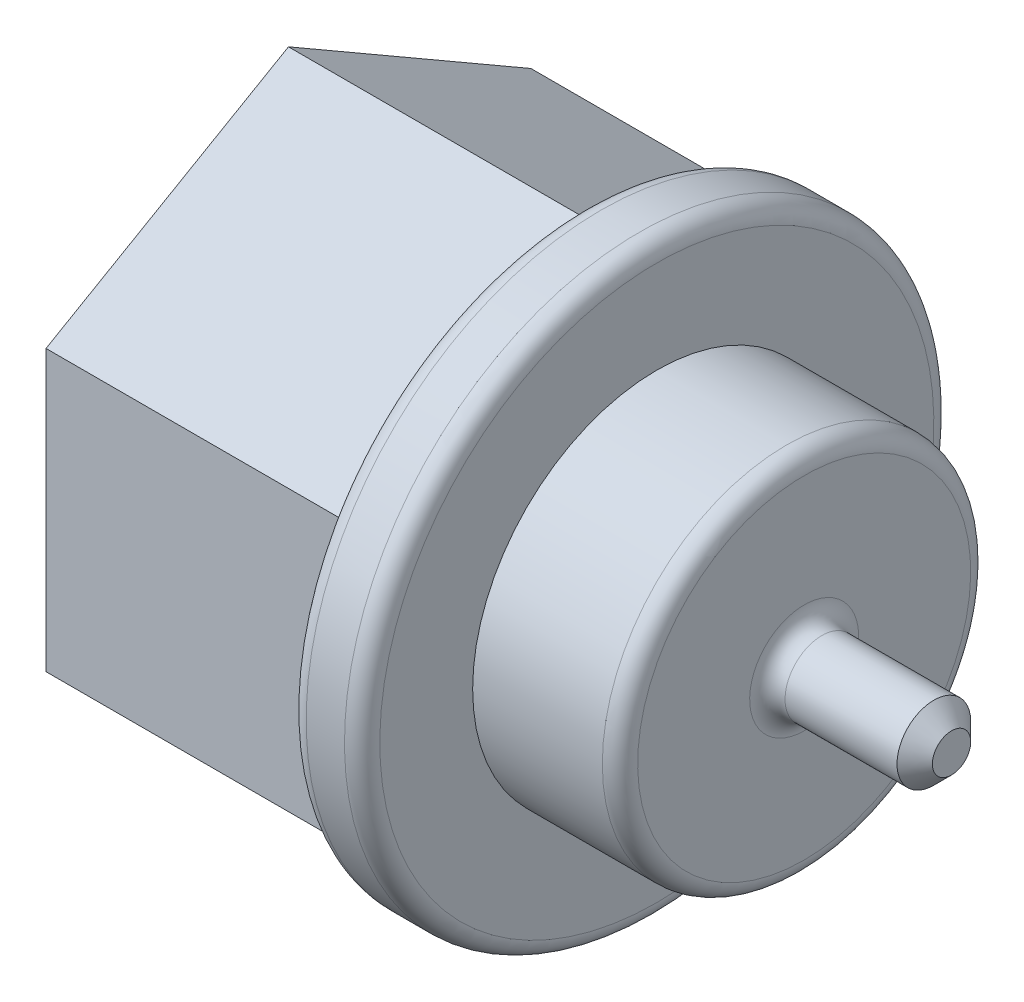
ISO-10303-21;
HEADER;
FILE_DESCRIPTION(('STEP AP214'),'2;1');
FILE_NAME('part.step','',(''),(''),'','','');
FILE_SCHEMA(('AUTOMOTIVE_DESIGN { 1 0 10303 214 1 1 1 1 }'));
ENDSEC;
DATA;
#1=APPLICATION_CONTEXT('core data for automotive mechanical design processes');
#2=APPLICATION_PROTOCOL_DEFINITION('international standard','automotive_design',2000,#1);
#3=PRODUCT_CONTEXT('',#1,'mechanical');
#4=PRODUCT('Part','Part','',(#3));
#5=PRODUCT_RELATED_PRODUCT_CATEGORY('part','',(#4));
#6=PRODUCT_DEFINITION_FORMATION('','',#4);
#7=PRODUCT_DEFINITION_CONTEXT('part definition',#1,'design');
#8=PRODUCT_DEFINITION('design','',#6,#7);
#9=PRODUCT_DEFINITION_SHAPE('','',#8);
#10=(LENGTH_UNIT() NAMED_UNIT(*) SI_UNIT(.MILLI.,.METRE.));
#11=(NAMED_UNIT(*) PLANE_ANGLE_UNIT() SI_UNIT($,.RADIAN.));
#12=(NAMED_UNIT(*) SI_UNIT($,.STERADIAN.) SOLID_ANGLE_UNIT());
#13=UNCERTAINTY_MEASURE_WITH_UNIT(LENGTH_MEASURE(1.E-05),#10,'distance_accuracy_value','');
#14=(GEOMETRIC_REPRESENTATION_CONTEXT(3) GLOBAL_UNCERTAINTY_ASSIGNED_CONTEXT((#13)) GLOBAL_UNIT_ASSIGNED_CONTEXT((#10,
#11,#12)) REPRESENTATION_CONTEXT('',''));
#15=CARTESIAN_POINT('',(0.,0.,0.));
#16=DIRECTION('',(0.,0.,1.));
#17=DIRECTION('',(1.,0.,0.));
#18=AXIS2_PLACEMENT_3D('',#15,#16,#17);
#19=CARTESIAN_POINT('',(0.,12.7,0.));
#20=DIRECTION('',(1.,0.,0.));
#21=DIRECTION('',(0.,1.,0.));
#22=AXIS2_PLACEMENT_3D('',#19,#20,#21);
#23=PLANE('',#22);
#24=DIRECTION('',(0.,-0.5,-0.866025403784439));
#25=VECTOR('',#24,1.);
#26=CARTESIAN_POINT('',(0.,9.04875,-5.22429824832963));
#27=LINE('',#26,#25);
#28=CARTESIAN_POINT('',(0.,11.9359058344675,-0.223597653662928));
#29=VERTEX_POINT('',#28);
#30=CARTESIAN_POINT('',(0.,6.16159416553246,-10.2249988429963));
#31=VERTEX_POINT('',#30);
#32=EDGE_CURVE('E199',#29,#31,#27,.T.);
#33=ORIENTED_EDGE('',*,*,#32,.F.);
#34=CARTESIAN_POINT('',(0.,0.,0.));
#35=DIRECTION('',(1.,0.,0.));
#36=DIRECTION('',(0.,1.,0.));
#37=AXIS2_PLACEMENT_3D('',#34,#35,#36);
#38=CIRCLE('',#37,11.938);
#39=EDGE_CURVE('E238',#29,#31,#38,.F.);
#40=ORIENTED_EDGE('',*,*,#39,.T.);
#41=EDGE_LOOP('',(#33,#40));
#42=FACE_BOUND('',#41,.T.);
#43=ADVANCED_FACE('F63',(#42),#23,.F.);
#44=DIRECTION('',(0.,-1.,0.));
#45=VECTOR('',#44,1.);
#46=CARTESIAN_POINT('',(0.,0.,-10.4485964966593));
#47=LINE('',#46,#45);
#48=CARTESIAN_POINT('',(0.,5.77431166893509,-10.4485964966593));
#49=VERTEX_POINT('',#48);
#50=CARTESIAN_POINT('',(0.,-5.77431166893509,-10.4485964966593));
#51=VERTEX_POINT('',#50);
#52=EDGE_CURVE('E202',#49,#51,#47,.T.);
#53=ORIENTED_EDGE('',*,*,#52,.F.);
#54=CARTESIAN_POINT('',(0.,0.,0.));
#55=DIRECTION('',(1.,0.,0.));
#56=DIRECTION('',(0.,1.,0.));
#57=AXIS2_PLACEMENT_3D('',#54,#55,#56);
#58=CIRCLE('',#57,11.938);
#59=EDGE_CURVE('E236',#49,#51,#58,.F.);
#60=ORIENTED_EDGE('',*,*,#59,.T.);
#61=EDGE_LOOP('',(#53,#60));
#62=FACE_BOUND('',#61,.T.);
#63=ADVANCED_FACE('F429',(#62),#23,.F.);
#64=DIRECTION('',(0.,-0.5,0.866025403784439));
#65=VECTOR('',#64,1.);
#66=CARTESIAN_POINT('',(0.,-9.04875,-5.22429824832963));
#67=LINE('',#66,#65);
#68=CARTESIAN_POINT('',(0.,-6.16159416553246,-10.2249988429963));
#69=VERTEX_POINT('',#68);
#70=CARTESIAN_POINT('',(0.,-11.9359058344675,-0.223597653662928));
#71=VERTEX_POINT('',#70);
#72=EDGE_CURVE('E180',#69,#71,#67,.T.);
#73=ORIENTED_EDGE('',*,*,#72,.F.);
#74=CARTESIAN_POINT('',(0.,0.,0.));
#75=DIRECTION('',(1.,0.,0.));
#76=DIRECTION('',(0.,1.,0.));
#77=AXIS2_PLACEMENT_3D('',#74,#75,#76);
#78=CIRCLE('',#77,11.938);
#79=EDGE_CURVE('E234',#69,#71,#78,.F.);
#80=ORIENTED_EDGE('',*,*,#79,.T.);
#81=EDGE_LOOP('',(#73,#80));
#82=FACE_BOUND('',#81,.T.);
#83=ADVANCED_FACE('F434',(#82),#23,.F.);
#84=DIRECTION('',(0.,0.5,0.866025403784439));
#85=VECTOR('',#84,1.);
#86=CARTESIAN_POINT('',(0.,-9.04875,5.22429824832963));
#87=LINE('',#86,#85);
#88=CARTESIAN_POINT('',(0.,-11.9359058344675,0.223597653662922));
#89=VERTEX_POINT('',#88);
#90=CARTESIAN_POINT('',(0.,-6.16159416553246,10.2249988429963));
#91=VERTEX_POINT('',#90);
#92=EDGE_CURVE('E165',#89,#91,#87,.T.);
#93=ORIENTED_EDGE('',*,*,#92,.F.);
#94=CARTESIAN_POINT('',(0.,0.,0.));
#95=DIRECTION('',(1.,0.,0.));
#96=DIRECTION('',(0.,1.,0.));
#97=AXIS2_PLACEMENT_3D('',#94,#95,#96);
#98=CIRCLE('',#97,11.938);
#99=EDGE_CURVE('E232',#89,#91,#98,.F.);
#100=ORIENTED_EDGE('',*,*,#99,.T.);
#101=EDGE_LOOP('',(#93,#100));
#102=FACE_BOUND('',#101,.T.);
#103=ADVANCED_FACE('F546',(#102),#23,.F.);
#104=DIRECTION('',(0.,1.,0.));
#105=VECTOR('',#104,1.);
#106=CARTESIAN_POINT('',(0.,0.,10.4485964966593));
#107=LINE('',#106,#105);
#108=CARTESIAN_POINT('',(0.,-5.7743116689351,10.4485964966593));
#109=VERTEX_POINT('',#108);
#110=CARTESIAN_POINT('',(0.,5.77431166893509,10.4485964966593));
#111=VERTEX_POINT('',#110);
#112=EDGE_CURVE('E169',#109,#111,#107,.T.);
#113=ORIENTED_EDGE('',*,*,#112,.F.);
#114=CARTESIAN_POINT('',(0.,0.,0.));
#115=DIRECTION('',(1.,0.,0.));
#116=DIRECTION('',(0.,1.,0.));
#117=AXIS2_PLACEMENT_3D('',#114,#115,#116);
#118=CIRCLE('',#117,11.938);
#119=EDGE_CURVE('E230',#109,#111,#118,.F.);
#120=ORIENTED_EDGE('',*,*,#119,.T.);
#121=EDGE_LOOP('',(#113,#120));
#122=FACE_BOUND('',#121,.T.);
#123=ADVANCED_FACE('F425',(#122),#23,.F.);
#124=DIRECTION('',(0.,0.5,-0.866025403784439));
#125=VECTOR('',#124,1.);
#126=CARTESIAN_POINT('',(0.,9.04875,5.22429824832963));
#127=LINE('',#126,#125);
#128=CARTESIAN_POINT('',(0.,6.16159416553246,10.2249988429963));
#129=VERTEX_POINT('',#128);
#130=CARTESIAN_POINT('',(0.,11.9359058344675,0.223597653662925));
#131=VERTEX_POINT('',#130);
#132=EDGE_CURVE('E196',#129,#131,#127,.T.);
#133=ORIENTED_EDGE('',*,*,#132,.F.);
#134=CARTESIAN_POINT('',(0.,0.,0.));
#135=DIRECTION('',(1.,0.,0.));
#136=DIRECTION('',(0.,1.,0.));
#137=AXIS2_PLACEMENT_3D('',#134,#135,#136);
#138=CIRCLE('',#137,11.938);
#139=EDGE_CURVE('E228',#129,#131,#138,.F.);
#140=ORIENTED_EDGE('',*,*,#139,.T.);
#141=EDGE_LOOP('',(#133,#140));
#142=FACE_BOUND('',#141,.T.);
#143=ADVANCED_FACE('F416',(#142),#23,.F.);
#144=CARTESIAN_POINT('',(3.175,7.9375,0.));
#145=DIRECTION('',(-1.,0.,0.));
#146=DIRECTION('',(0.,-1.,0.));
#147=AXIS2_PLACEMENT_3D('',#144,#145,#146);
#148=PLANE('',#147);
#149=CARTESIAN_POINT('',(3.175,0.,0.));
#150=DIRECTION('',(-1.,0.,0.));
#151=DIRECTION('',(0.,-1.,0.));
#152=AXIS2_PLACEMENT_3D('',#149,#150,#151);
#153=CIRCLE('',#152,11.938);
#154=CARTESIAN_POINT('',(3.17499999999999,-11.938,0.));
#155=VERTEX_POINT('',#154);
#156=EDGE_CURVE('E247',#155,#155,#153,.F.);
#157=ORIENTED_EDGE('',*,*,#156,.T.);
#158=EDGE_LOOP('',(#157));
#159=FACE_BOUND('',#158,.T.);
#160=CARTESIAN_POINT('',(3.175,0.,0.));
#161=DIRECTION('',(-1.,0.,0.));
#162=DIRECTION('',(0.,-1.,0.));
#163=AXIS2_PLACEMENT_3D('',#160,#161,#162);
#164=CIRCLE('',#163,7.9375);
#165=CARTESIAN_POINT('',(3.175,-7.9375,0.));
#166=VERTEX_POINT('',#165);
#167=EDGE_CURVE('E219',#166,#166,#164,.T.);
#168=ORIENTED_EDGE('',*,*,#167,.T.);
#169=EDGE_LOOP('',(#168));
#170=FACE_BOUND('',#169,.T.);
#171=ADVANCED_FACE('F418',(#159,#170),#148,.F.);
#172=CARTESIAN_POINT('',(0.,0.,0.));
#173=DIRECTION('',(-1.,0.,0.));
#174=DIRECTION('',(0.,-1.,0.));
#175=AXIS2_PLACEMENT_3D('',#172,#173,#174);
#176=CYLINDRICAL_SURFACE('',#175,12.7);
#177=CARTESIAN_POINT('',(0.761999999999999,0.,0.));
#178=DIRECTION('',(1.,0.,0.));
#179=DIRECTION('',(0.,1.,0.));
#180=AXIS2_PLACEMENT_3D('',#177,#178,#179);
#181=CIRCLE('',#180,12.7);
#182=CARTESIAN_POINT('',(0.762000000000002,12.7,0.));
#183=VERTEX_POINT('',#182);
#184=EDGE_CURVE('E244',#183,#183,#181,.T.);
#185=ORIENTED_EDGE('',*,*,#184,.T.);
#186=EDGE_LOOP('',(#185));
#187=FACE_BOUND('',#186,.T.);
#188=CARTESIAN_POINT('',(2.413,0.,0.));
#189=DIRECTION('',(-1.,0.,0.));
#190=DIRECTION('',(0.,-1.,0.));
#191=AXIS2_PLACEMENT_3D('',#188,#189,#190);
#192=CIRCLE('',#191,12.7);
#193=CARTESIAN_POINT('',(2.41299999999999,-12.7,0.));
#194=VERTEX_POINT('',#193);
#195=EDGE_CURVE('E241',#194,#194,#192,.T.);
#196=ORIENTED_EDGE('',*,*,#195,.T.);
#197=EDGE_LOOP('',(#196));
#198=FACE_BOUND('',#197,.T.);
#199=ADVANCED_FACE('F411',(#187,#198),#176,.T.);
#200=CARTESIAN_POINT('',(15.875,1.5875,0.));
#201=DIRECTION('',(-1.,0.,0.));
#202=DIRECTION('',(0.,-1.,0.));
#203=AXIS2_PLACEMENT_3D('',#200,#201,#202);
#204=PLANE('',#203);
#205=CARTESIAN_POINT('',(15.875,0.,0.));
#206=DIRECTION('',(-1.,0.,0.));
#207=DIRECTION('',(0.,-1.,0.));
#208=AXIS2_PLACEMENT_3D('',#205,#206,#207);
#209=CIRCLE('',#208,0.825500000000007);
#210=CARTESIAN_POINT('',(15.875,-0.825500000000012,0.));
#211=VERTEX_POINT('',#210);
#212=EDGE_CURVE('E225',#211,#211,#209,.F.);
#213=ORIENTED_EDGE('',*,*,#212,.T.);
#214=EDGE_LOOP('',(#213));
#215=FACE_BOUND('',#214,.T.);
#216=ADVANCED_FACE('F407',(#215),#204,.F.);
#217=CARTESIAN_POINT('',(0.,0.,0.));
#218=DIRECTION('',(-1.,0.,0.));
#219=DIRECTION('',(0.,-1.,0.));
#220=AXIS2_PLACEMENT_3D('',#217,#218,#219);
#221=CYLINDRICAL_SURFACE('',#220,1.5875);
#222=CARTESIAN_POINT('',(10.287,0.,0.));
#223=DIRECTION('',(-1.,0.,0.));
#224=DIRECTION('',(0.,-1.,0.));
#225=AXIS2_PLACEMENT_3D('',#222,#223,#224);
#226=CIRCLE('',#225,1.5875);
#227=CARTESIAN_POINT('',(10.287,-1.5875,0.));
#228=VERTEX_POINT('',#227);
#229=EDGE_CURVE('E256',#228,#228,#226,.F.);
#230=ORIENTED_EDGE('',*,*,#229,.T.);
#231=EDGE_LOOP('',(#230));
#232=FACE_BOUND('',#231,.T.);
#233=CARTESIAN_POINT('',(15.113,0.,0.));
#234=DIRECTION('',(-1.,0.,0.));
#235=DIRECTION('',(0.,-1.,0.));
#236=AXIS2_PLACEMENT_3D('',#233,#234,#235);
#237=CIRCLE('',#236,1.5875);
#238=CARTESIAN_POINT('',(15.113,-1.58750000000001,0.));
#239=VERTEX_POINT('',#238);
#240=EDGE_CURVE('E222',#239,#239,#237,.T.);
#241=ORIENTED_EDGE('',*,*,#240,.T.);
#242=EDGE_LOOP('',(#241));
#243=FACE_BOUND('',#242,.T.);
#244=ADVANCED_FACE('F403',(#232,#243),#221,.T.);
#245=CARTESIAN_POINT('',(9.525,7.9375,0.));
#246=DIRECTION('',(-1.,0.,0.));
#247=DIRECTION('',(0.,-1.,0.));
#248=AXIS2_PLACEMENT_3D('',#245,#246,#247);
#249=PLANE('',#248);
#250=CARTESIAN_POINT('',(9.525,0.,0.));
#251=DIRECTION('',(-1.,0.,0.));
#252=DIRECTION('',(0.,-1.,0.));
#253=AXIS2_PLACEMENT_3D('',#250,#251,#252);
#254=CIRCLE('',#253,2.3495);
#255=CARTESIAN_POINT('',(9.525,-2.3495,0.));
#256=VERTEX_POINT('',#255);
#257=EDGE_CURVE('E253',#256,#256,#254,.T.);
#258=ORIENTED_EDGE('',*,*,#257,.T.);
#259=EDGE_LOOP('',(#258));
#260=FACE_BOUND('',#259,.T.);
#261=CARTESIAN_POINT('',(9.525,0.,0.));
#262=DIRECTION('',(-1.,0.,0.));
#263=DIRECTION('',(0.,-1.,0.));
#264=AXIS2_PLACEMENT_3D('',#261,#262,#263);
#265=CIRCLE('',#264,7.1755);
#266=CARTESIAN_POINT('',(9.525,-7.1755,0.));
#267=VERTEX_POINT('',#266);
#268=EDGE_CURVE('E250',#267,#267,#265,.F.);
#269=ORIENTED_EDGE('',*,*,#268,.T.);
#270=EDGE_LOOP('',(#269));
#271=FACE_BOUND('',#270,.T.);
#272=ADVANCED_FACE('F399',(#260,#271),#249,.F.);
#273=CARTESIAN_POINT('',(0.,0.,0.));
#274=DIRECTION('',(-1.,0.,0.));
#275=DIRECTION('',(0.,-1.,0.));
#276=AXIS2_PLACEMENT_3D('',#273,#274,#275);
#277=CYLINDRICAL_SURFACE('',#276,7.9375);
#278=CARTESIAN_POINT('',(8.763,0.,0.));
#279=DIRECTION('',(-1.,0.,0.));
#280=DIRECTION('',(0.,-1.,0.));
#281=AXIS2_PLACEMENT_3D('',#278,#279,#280);
#282=CIRCLE('',#281,7.9375);
#283=CARTESIAN_POINT('',(8.76299999999999,-7.9375,0.));
#284=VERTEX_POINT('',#283);
#285=EDGE_CURVE('E259',#284,#284,#282,.T.);
#286=ORIENTED_EDGE('',*,*,#285,.T.);
#287=EDGE_LOOP('',(#286));
#288=FACE_BOUND('',#287,.T.);
#289=ORIENTED_EDGE('',*,*,#167,.F.);
#290=EDGE_LOOP('',(#289));
#291=FACE_BOUND('',#290,.T.);
#292=ADVANCED_FACE('F379',(#288,#291),#277,.T.);
#293=CARTESIAN_POINT('',(-12.7,-9.04875,5.22429824832963));
#294=DIRECTION('',(0.,0.866025403784439,-0.5));
#295=DIRECTION('',(0.,0.5,0.866025403784439));
#296=AXIS2_PLACEMENT_3D('',#293,#294,#295);
#297=PLANE('',#296);
#298=DIRECTION('',(1.,0.,0.));
#299=VECTOR('',#298,1.);
#300=CARTESIAN_POINT('',(-12.7,-12.065,0.));
#301=LINE('',#300,#299);
#302=CARTESIAN_POINT('',(-12.7,-12.065,0.));
#303=VERTEX_POINT('',#302);
#304=CARTESIAN_POINT('',(0.0106578675463462,-12.065,0.));
#305=VERTEX_POINT('',#304);
#306=EDGE_CURVE('E192',#303,#305,#301,.T.);
#307=ORIENTED_EDGE('',*,*,#306,.T.);
#308=CARTESIAN_POINT('',(0.0106578675463457,-12.065,0.));
#309=CARTESIAN_POINT('',(0.00884371609623041,-12.0542654441316,0.0185927961606871));
#310=CARTESIAN_POINT('',(0.00727111135304948,-12.043520871396,0.0372029420444711));
#311=CARTESIAN_POINT('',(0.00459420495345309,-12.0220219005288,0.0744402518969401));
#312=CARTESIAN_POINT('',(0.00348969616978395,-12.0112675088575,0.0930674046759978));
#313=CARTESIAN_POINT('',(0.00173263033494865,-11.9897498192298,0.130337136372655));
#314=CARTESIAN_POINT('',(0.00108006361396421,-11.9789865214689,0.148979714951657));
#315=CARTESIAN_POINT('',(0.000213778414528371,-11.9574507180435,0.186280820666164));
#316=CARTESIAN_POINT('',(2.54525238986549E-07,-11.9466782104124,0.204939351208226));
#317=CARTESIAN_POINT('',(0.,-11.9359058344675,0.223597653662922));
#318=B_SPLINE_CURVE_WITH_KNOTS('',3,(#308,#309,#310,#311,#312,#313,#314,#315,#316,#317),
.UNSPECIFIED.,.F.,.F.,(4,2,2,2,4),(0.,0.0646349645531449,0.1292412989167,0.193846250910993,
0.258479830444874),.UNSPECIFIED.);
#319=EDGE_CURVE('E320',#305,#89,#318,.T.);
#320=ORIENTED_EDGE('',*,*,#319,.T.);
#321=ORIENTED_EDGE('',*,*,#92,.T.);
#322=CARTESIAN_POINT('',(0.,-6.16159416553246,10.2249988429963));
#323=CARTESIAN_POINT('',(2.54525242232E-07,-6.15082178958762,10.243657145451));
#324=CARTESIAN_POINT('',(0.000213778414530523,-6.14004928195647,10.2623156759931));
#325=CARTESIAN_POINT('',(0.00108006361396427,-6.11851347853113,10.2996167817076));
#326=CARTESIAN_POINT('',(0.00173263033494773,-6.10775018077016,10.3182593602866));
#327=CARTESIAN_POINT('',(0.00348969616978725,-6.08623249114247,10.3555290919833));
#328=CARTESIAN_POINT('',(0.00459420495346159,-6.07547809947124,10.3741562447623));
#329=CARTESIAN_POINT('',(0.00727111135304284,-6.05397912860402,10.4113935546148));
#330=CARTESIAN_POINT('',(0.00884371609620344,-6.04323455586836,10.4300037004986));
#331=CARTESIAN_POINT('',(0.0106578675462697,-6.0325,10.4485964966593));
#332=B_SPLINE_CURVE_WITH_KNOTS('',3,(#322,#323,#324,#325,#326,#327,#328,#329,#330,#331),
.UNSPECIFIED.,.F.,.F.,(4,2,2,2,4),(0.,0.0646335795338792,0.12923853152817,0.193844865891721,
0.258479830444864),.UNSPECIFIED.);
#333=CARTESIAN_POINT('',(0.0106578675463462,-6.0325,10.4485964966593));
#334=VERTEX_POINT('',#333);
#335=EDGE_CURVE('E328',#91,#334,#332,.T.);
#336=ORIENTED_EDGE('',*,*,#335,.T.);
#337=DIRECTION('',(1.,0.,0.));
#338=VECTOR('',#337,1.);
#339=CARTESIAN_POINT('',(-12.7,-6.0325,10.4485964966593));
#340=LINE('',#339,#338);
#341=CARTESIAN_POINT('',(-12.7,-6.0325,10.4485964966593));
#342=VERTEX_POINT('',#341);
#343=EDGE_CURVE('E214',#342,#334,#340,.T.);
#344=ORIENTED_EDGE('',*,*,#343,.F.);
#345=DIRECTION('',(0.,0.5,0.866025403784439));
#346=VECTOR('',#345,1.);
#347=CARTESIAN_POINT('',(-12.7,-9.04875,5.22429824832963));
#348=LINE('',#347,#346);
#349=EDGE_CURVE('E179',#303,#342,#348,.T.);
#350=ORIENTED_EDGE('',*,*,#349,.F.);
#351=EDGE_LOOP('',(#307,#320,#321,#336,#344,#350));
#352=FACE_BOUND('',#351,.T.);
#353=ADVANCED_FACE('F373',(#352),#297,.F.);
#354=CARTESIAN_POINT('',(-12.7,0.,10.4485964966593));
#355=DIRECTION('',(0.,0.,-1.));
#356=DIRECTION('',(0.,1.,0.));
#357=AXIS2_PLACEMENT_3D('',#354,#355,#356);
#358=PLANE('',#357);
#359=ORIENTED_EDGE('',*,*,#343,.T.);
#360=CARTESIAN_POINT('',(0.0106578675463467,-6.0325,10.4485964966593));
#361=CARTESIAN_POINT('',(0.00884371609623133,-6.01103088826328,10.4485964966593));
#362=CARTESIAN_POINT('',(0.00727111135305044,-5.98954174279196,10.4485964966593));
#363=CARTESIAN_POINT('',(0.00459420495345417,-5.94654380105752,10.4485964966593));
#364=CARTESIAN_POINT('',(0.00348969616978512,-5.92503501771507,10.4485964966593));
#365=CARTESIAN_POINT('',(0.00173263033494987,-5.88199963845969,10.4485964966593));
#366=CARTESIAN_POINT('',(0.0010800636139654,-5.86047304293774,10.4485964966593));
#367=CARTESIAN_POINT('',(0.000213778414529594,-5.81740143608706,10.4485964966593));
#368=CARTESIAN_POINT('',(2.54525240240313E-07,-5.79585642082477,10.4485964966593));
#369=CARTESIAN_POINT('',(0.,-5.77431166893509,10.4485964966593));
#370=B_SPLINE_CURVE_WITH_KNOTS('',3,(#360,#361,#362,#363,#364,#365,#366,#367,#368,#369),
.UNSPECIFIED.,.F.,.F.,(4,2,2,2,4),(0.,0.0646349645531434,0.129241298916697,0.193846250910989,
0.258479830444868),.UNSPECIFIED.);
#371=EDGE_CURVE('E335',#334,#109,#370,.T.);
#372=ORIENTED_EDGE('',*,*,#371,.T.);
#373=ORIENTED_EDGE('',*,*,#112,.T.);
#374=CARTESIAN_POINT('',(0.,5.77431166893509,10.4485964966593));
#375=CARTESIAN_POINT('',(2.54525244852478E-07,5.79585642082477,10.4485964966593));
#376=CARTESIAN_POINT('',(0.000213778414533182,5.81740143608706,10.4485964966593));
#377=CARTESIAN_POINT('',(0.00108006361396697,5.86047304293774,10.4485964966593));
#378=CARTESIAN_POINT('',(0.00173263033495044,5.88199963845969,10.4485964966593));
#379=CARTESIAN_POINT('',(0.00348969616978999,5.92503501771507,10.4485964966593));
#380=CARTESIAN_POINT('',(0.00459420495346432,5.94654380105752,10.4485964966593));
#381=CARTESIAN_POINT('',(0.00727111135304558,5.98954174279196,10.4485964966593));
#382=CARTESIAN_POINT('',(0.00884371609620618,6.01103088826328,10.4485964966593));
#383=CARTESIAN_POINT('',(0.0106578675462725,6.03250000000001,10.4485964966593));
#384=B_SPLINE_CURVE_WITH_KNOTS('',3,(#374,#375,#376,#377,#378,#379,#380,#381,#382,#383),
.UNSPECIFIED.,.F.,.F.,(4,2,2,2,4),(0.,0.0646335795338805,0.129238531528174,0.193844865891726,
0.258479830444868),.UNSPECIFIED.);
#385=CARTESIAN_POINT('',(0.0106578675463497,6.0325,10.4485964966593));
#386=VERTEX_POINT('',#385);
#387=EDGE_CURVE('E343',#111,#386,#384,.T.);
#388=ORIENTED_EDGE('',*,*,#387,.T.);
#389=DIRECTION('',(1.,0.,0.));
#390=VECTOR('',#389,1.);
#391=CARTESIAN_POINT('',(-12.7,6.03250000000001,10.4485964966593));
#392=LINE('',#391,#390);
#393=CARTESIAN_POINT('',(-12.7,6.03250000000001,10.4485964966593));
#394=VERTEX_POINT('',#393);
#395=EDGE_CURVE('E86',#394,#386,#392,.T.);
#396=ORIENTED_EDGE('',*,*,#395,.F.);
#397=DIRECTION('',(0.,1.,0.));
#398=VECTOR('',#397,1.);
#399=CARTESIAN_POINT('',(-12.7,0.,10.4485964966593));
#400=LINE('',#399,#398);
#401=EDGE_CURVE('E183',#342,#394,#400,.T.);
#402=ORIENTED_EDGE('',*,*,#401,.F.);
#403=EDGE_LOOP('',(#359,#372,#373,#388,#396,#402));
#404=FACE_BOUND('',#403,.T.);
#405=ADVANCED_FACE('F369',(#404),#358,.F.);
#406=CARTESIAN_POINT('',(-12.7,9.04875000000001,5.22429824832963));
#407=DIRECTION('',(0.,-0.866025403784439,-0.5));
#408=DIRECTION('',(0.,0.5,-0.866025403784439));
#409=AXIS2_PLACEMENT_3D('',#406,#407,#408);
#410=PLANE('',#409);
#411=ORIENTED_EDGE('',*,*,#395,.T.);
#412=CARTESIAN_POINT('',(0.0106578675463495,6.03250000000001,10.4485964966593));
#413=CARTESIAN_POINT('',(0.00884371609623417,6.04323455586836,10.4300037004986));
#414=CARTESIAN_POINT('',(0.00727111135305328,6.05397912860403,10.4113935546148));
#415=CARTESIAN_POINT('',(0.00459420495345708,6.07547809947125,10.3741562447623));
#416=CARTESIAN_POINT('',(0.00348969616978806,6.08623249114247,10.3555290919833));
#417=CARTESIAN_POINT('',(0.00173263033495269,6.10775018077016,10.3182593602866));
#418=CARTESIAN_POINT('',(0.00108006361396808,6.11851347853114,10.2996167817076));
#419=CARTESIAN_POINT('',(0.000213778414532072,6.14004928195648,10.2623156759931));
#420=CARTESIAN_POINT('',(2.54525242677288E-07,6.15082178958762,10.243657145451));
#421=CARTESIAN_POINT('',(0.,6.16159416553246,10.2249988429963));
#422=B_SPLINE_CURVE_WITH_KNOTS('',3,(#412,#413,#414,#415,#416,#417,#418,#419,#420,#421),
.UNSPECIFIED.,.F.,.F.,(4,2,2,2,4),(0.,0.0646349645531461,0.129241298916699,0.193846250910993,
0.258479830444876),.UNSPECIFIED.);
#423=EDGE_CURVE('E349',#386,#129,#422,.T.);
#424=ORIENTED_EDGE('',*,*,#423,.T.);
#425=ORIENTED_EDGE('',*,*,#132,.T.);
#426=CARTESIAN_POINT('',(0.,11.9359058344675,0.223597653662925));
#427=CARTESIAN_POINT('',(2.5452524618381E-07,11.9466782104124,0.204939351208228));
#428=CARTESIAN_POINT('',(0.000213778414534531,11.9574507180435,0.186280820666166));
#429=CARTESIAN_POINT('',(0.00108006361396837,11.9789865214689,0.148979714951659));
#430=CARTESIAN_POINT('',(0.00173263033495188,11.9897498192298,0.130337136372657));
#431=CARTESIAN_POINT('',(0.00348969616979152,12.0112675088575,0.0930674046759999));
#432=CARTESIAN_POINT('',(0.00459420495346591,12.0220219005288,0.0744402518969428));
#433=CARTESIAN_POINT('',(0.00727111135304723,12.043520871396,0.0372029420444734));
#434=CARTESIAN_POINT('',(0.00884371609620782,12.0542654441316,0.0185927961606884));
#435=CARTESIAN_POINT('',(0.010657867546274,12.065,0.));
#436=B_SPLINE_CURVE_WITH_KNOTS('',3,(#426,#427,#428,#429,#430,#431,#432,#433,#434,#435),
.UNSPECIFIED.,.F.,.F.,(4,2,2,2,4),(0.,0.0646335795338809,0.129238531528175,0.193844865891729,
0.258479830444872),.UNSPECIFIED.);
#437=CARTESIAN_POINT('',(0.0106578675463515,12.065,0.));
#438=VERTEX_POINT('',#437);
#439=EDGE_CURVE('E355',#131,#438,#436,.T.);
#440=ORIENTED_EDGE('',*,*,#439,.T.);
#441=DIRECTION('',(1.,0.,0.));
#442=VECTOR('',#441,1.);
#443=CARTESIAN_POINT('',(-12.7,12.065,0.));
#444=LINE('',#443,#442);
#445=CARTESIAN_POINT('',(-12.7,12.065,0.));
#446=VERTEX_POINT('',#445);
#447=EDGE_CURVE('E78',#446,#438,#444,.T.);
#448=ORIENTED_EDGE('',*,*,#447,.F.);
#449=DIRECTION('',(0.,0.5,-0.866025403784439));
#450=VECTOR('',#449,1.);
#451=CARTESIAN_POINT('',(-12.7,9.04875000000001,5.22429824832963));
#452=LINE('',#451,#450);
#453=EDGE_CURVE('E185',#394,#446,#452,.T.);
#454=ORIENTED_EDGE('',*,*,#453,.F.);
#455=EDGE_LOOP('',(#411,#424,#425,#440,#448,#454));
#456=FACE_BOUND('',#455,.T.);
#457=ADVANCED_FACE('F366',(#456),#410,.F.);
#458=CARTESIAN_POINT('',(-12.7,9.04875,-5.22429824832963));
#459=DIRECTION('',(0.,-0.866025403784439,0.5));
#460=DIRECTION('',(0.,-0.5,-0.866025403784439));
#461=AXIS2_PLACEMENT_3D('',#458,#459,#460);
#462=PLANE('',#461);
#463=ORIENTED_EDGE('',*,*,#447,.T.);
#464=CARTESIAN_POINT('',(0.0106578675463511,12.065,0.));
#465=CARTESIAN_POINT('',(0.00884371609623584,12.0542654441316,-0.018592796160686));
#466=CARTESIAN_POINT('',(0.00727111135305494,12.043520871396,-0.0372029420444701));
#467=CARTESIAN_POINT('',(0.00459420495345854,12.0220219005288,-0.0744402518969398));
#468=CARTESIAN_POINT('',(0.00348969616978939,12.0112675088575,-0.0930674046759981));
#469=CARTESIAN_POINT('',(0.00173263033495397,11.9897498192298,-0.130337136372657));
#470=CARTESIAN_POINT('',(0.00108006361396942,11.9789865214689,-0.148979714951659));
#471=CARTESIAN_POINT('',(0.000213778414533463,11.9574507180435,-0.186280820666167));
#472=CARTESIAN_POINT('',(2.54525244051203E-07,11.9466782104124,-0.204939351208229));
#473=CARTESIAN_POINT('',(0.,11.9359058344675,-0.223597653662926));
#474=B_SPLINE_CURVE_WITH_KNOTS('',3,(#464,#465,#466,#467,#468,#469,#470,#471,#472,#473),
.UNSPECIFIED.,.F.,.F.,(4,2,2,2,4),(0.,0.0646349645531449,0.129241298916701,0.193846250910996,
0.258479830444879),.UNSPECIFIED.);
#475=EDGE_CURVE('E360',#438,#29,#474,.T.);
#476=ORIENTED_EDGE('',*,*,#475,.T.);
#477=ORIENTED_EDGE('',*,*,#32,.T.);
#478=CARTESIAN_POINT('',(0.,6.16159416553246,-10.2249988429963));
#479=CARTESIAN_POINT('',(2.54525244944296E-07,6.15082178958762,-10.243657145451));
#480=CARTESIAN_POINT('',(0.00021377841453325,6.14004928195647,-10.2623156759931));
#481=CARTESIAN_POINT('',(0.00108006361396697,6.11851347853113,-10.2996167817076));
#482=CARTESIAN_POINT('',(0.00173263033495038,6.10775018077016,-10.3182593602866));
#483=CARTESIAN_POINT('',(0.00348969616978984,6.08623249114247,-10.3555290919833));
#484=CARTESIAN_POINT('',(0.00459420495346419,6.07547809947124,-10.3741562447623));
#485=CARTESIAN_POINT('',(0.00727111135304537,6.05397912860402,-10.4113935546148));
#486=CARTESIAN_POINT('',(0.00884371609620588,6.04323455586836,-10.4300037004986));
#487=CARTESIAN_POINT('',(0.0106578675462719,6.0325,-10.4485964966593));
#488=B_SPLINE_CURVE_WITH_KNOTS('',3,(#478,#479,#480,#481,#482,#483,#484,#485,#486,#487),
.UNSPECIFIED.,.F.,.F.,(4,2,2,2,4),(0.,0.0646335795338795,0.12923853152817,0.193844865891723,
0.258479830444866),.UNSPECIFIED.);
#489=CARTESIAN_POINT('',(0.0106578675463497,6.0325,-10.4485964966593));
#490=VERTEX_POINT('',#489);
#491=EDGE_CURVE('E262',#31,#490,#488,.T.);
#492=ORIENTED_EDGE('',*,*,#491,.T.);
#493=DIRECTION('',(1.,0.,0.));
#494=VECTOR('',#493,1.);
#495=CARTESIAN_POINT('',(-12.7,6.0325,-10.4485964966593));
#496=LINE('',#495,#494);
#497=CARTESIAN_POINT('',(-12.7,6.0325,-10.4485964966593));
#498=VERTEX_POINT('',#497);
#499=EDGE_CURVE('E210',#498,#490,#496,.T.);
#500=ORIENTED_EDGE('',*,*,#499,.F.);
#501=DIRECTION('',(0.,-0.5,-0.866025403784439));
#502=VECTOR('',#501,1.);
#503=CARTESIAN_POINT('',(-12.7,9.04875,-5.22429824832963));
#504=LINE('',#503,#502);
#505=EDGE_CURVE('E187',#446,#498,#504,.T.);
#506=ORIENTED_EDGE('',*,*,#505,.F.);
#507=EDGE_LOOP('',(#463,#476,#477,#492,#500,#506));
#508=FACE_BOUND('',#507,.T.);
#509=ADVANCED_FACE('F278',(#508),#462,.F.);
#510=CARTESIAN_POINT('',(-12.7,0.,-10.4485964966593));
#511=DIRECTION('',(0.,0.,1.));
#512=DIRECTION('',(0.,-1.,0.));
#513=AXIS2_PLACEMENT_3D('',#510,#511,#512);
#514=PLANE('',#513);
#515=ORIENTED_EDGE('',*,*,#499,.T.);
#516=CARTESIAN_POINT('',(0.0106578675463493,6.0325,-10.4485964966593));
#517=CARTESIAN_POINT('',(0.00884371609623383,6.01103088826328,-10.4485964966593));
#518=CARTESIAN_POINT('',(0.00727111135305291,5.98954174279196,-10.4485964966593));
#519=CARTESIAN_POINT('',(0.00459420495345671,5.94654380105752,-10.4485964966593));
#520=CARTESIAN_POINT('',(0.00348969616978774,5.92503501771507,-10.4485964966593));
#521=CARTESIAN_POINT('',(0.00173263033495257,5.88199963845969,-10.4485964966593));
#522=CARTESIAN_POINT('',(0.00108006361396809,5.86047304293774,-10.4485964966593));
#523=CARTESIAN_POINT('',(0.000213778414532177,5.81740143608706,-10.4485964966593));
#524=CARTESIAN_POINT('',(2.54525242741112E-07,5.79585642082477,-10.4485964966593));
#525=CARTESIAN_POINT('',(0.,5.77431166893509,-10.4485964966593));
#526=B_SPLINE_CURVE_WITH_KNOTS('',3,(#516,#517,#518,#519,#520,#521,#522,#523,#524,#525),
.UNSPECIFIED.,.F.,.F.,(4,2,2,2,4),(0.,0.0646349645531434,0.129241298916696,0.193846250910988,
0.258479830444868),.UNSPECIFIED.);
#527=EDGE_CURVE('E271',#490,#49,#526,.T.);
#528=ORIENTED_EDGE('',*,*,#527,.T.);
#529=ORIENTED_EDGE('',*,*,#52,.T.);
#530=CARTESIAN_POINT('',(0.,-5.77431166893509,-10.4485964966593));
#531=CARTESIAN_POINT('',(2.54525242362693E-07,-5.79585642082477,-10.4485964966593));
#532=CARTESIAN_POINT('',(0.000213778414530645,-5.81740143608705,-10.4485964966593));
#533=CARTESIAN_POINT('',(0.00108006361396435,-5.86047304293774,-10.4485964966593));
#534=CARTESIAN_POINT('',(0.00173263033494778,-5.88199963845969,-10.4485964966593));
#535=CARTESIAN_POINT('',(0.00348969616978731,-5.92503501771506,-10.4485964966593));
#536=CARTESIAN_POINT('',(0.00459420495346169,-5.94654380105751,-10.4485964966593));
#537=CARTESIAN_POINT('',(0.00727111135304289,-5.98954174279195,-10.4485964966593));
#538=CARTESIAN_POINT('',(0.00884371609620338,-6.01103088826328,-10.4485964966593));
#539=CARTESIAN_POINT('',(0.0106578675462694,-6.0325,-10.4485964966593));
#540=B_SPLINE_CURVE_WITH_KNOTS('',3,(#530,#531,#532,#533,#534,#535,#536,#537,#538,#539),
.UNSPECIFIED.,.F.,.F.,(4,2,2,2,4),(0.,0.0646335795338797,0.129238531528171,0.193844865891723,
0.258479830444863),.UNSPECIFIED.);
#541=CARTESIAN_POINT('',(0.0106578675463462,-6.0325,-10.4485964966593));
#542=VERTEX_POINT('',#541);
#543=EDGE_CURVE('E298',#51,#542,#540,.T.);
#544=ORIENTED_EDGE('',*,*,#543,.T.);
#545=DIRECTION('',(1.,0.,0.));
#546=VECTOR('',#545,1.);
#547=CARTESIAN_POINT('',(-12.7,-6.0325,-10.4485964966593));
#548=LINE('',#547,#546);
#549=CARTESIAN_POINT('',(-12.7,-6.0325,-10.4485964966593));
#550=VERTEX_POINT('',#549);
#551=EDGE_CURVE('E208',#550,#542,#548,.T.);
#552=ORIENTED_EDGE('',*,*,#551,.F.);
#553=DIRECTION('',(0.,-1.,0.));
#554=VECTOR('',#553,1.);
#555=CARTESIAN_POINT('',(-12.7,0.,-10.4485964966593));
#556=LINE('',#555,#554);
#557=EDGE_CURVE('E189',#498,#550,#556,.T.);
#558=ORIENTED_EDGE('',*,*,#557,.F.);
#559=EDGE_LOOP('',(#515,#528,#529,#544,#552,#558));
#560=FACE_BOUND('',#559,.T.);
#561=ADVANCED_FACE('F386',(#560),#514,.F.);
#562=CARTESIAN_POINT('',(-12.7,0.,0.));
#563=DIRECTION('',(1.,0.,0.));
#564=DIRECTION('',(0.,1.,0.));
#565=AXIS2_PLACEMENT_3D('',#562,#563,#564);
#566=CYLINDRICAL_SURFACE('',#565,9.68659649665925);
#567=CARTESIAN_POINT('',(-0.762000000000002,0.,0.));
#568=DIRECTION('',(1.,0.,0.));
#569=DIRECTION('',(0.,1.,0.));
#570=AXIS2_PLACEMENT_3D('',#567,#568,#569);
#571=CIRCLE('',#570,9.68659649665925);
#572=CARTESIAN_POINT('',(-0.762,9.68659649665925,0.));
#573=VERTEX_POINT('',#572);
#574=EDGE_CURVE('E71',#573,#573,#571,.T.);
#575=ORIENTED_EDGE('',*,*,#574,.T.);
#576=EDGE_LOOP('',(#575));
#577=FACE_BOUND('',#576,.T.);
#578=CARTESIAN_POINT('',(-12.7,0.,0.));
#579=DIRECTION('',(-1.,0.,0.));
#580=DIRECTION('',(0.,-1.,0.));
#581=AXIS2_PLACEMENT_3D('',#578,#579,#580);
#582=CIRCLE('',#581,9.68659649665925);
#583=CARTESIAN_POINT('',(-12.7,-9.68659649665925,0.));
#584=VERTEX_POINT('',#583);
#585=EDGE_CURVE('E176',#584,#584,#582,.T.);
#586=ORIENTED_EDGE('',*,*,#585,.T.);
#587=EDGE_LOOP('',(#586));
#588=FACE_BOUND('',#587,.T.);
#589=ADVANCED_FACE('F381',(#577,#588),#566,.F.);
#590=CARTESIAN_POINT('',(-12.7,-9.04875,-5.22429824832963));
#591=DIRECTION('',(0.,0.866025403784439,0.5));
#592=DIRECTION('',(0.,-0.5,0.866025403784439));
#593=AXIS2_PLACEMENT_3D('',#590,#591,#592);
#594=PLANE('',#593);
#595=ORIENTED_EDGE('',*,*,#551,.T.);
#596=CARTESIAN_POINT('',(0.0106578675463466,-6.0325,-10.4485964966593));
#597=CARTESIAN_POINT('',(0.00884371609623126,-6.04323455586836,-10.4300037004986));
#598=CARTESIAN_POINT('',(0.00727111135305037,-6.05397912860402,-10.4113935546148));
#599=CARTESIAN_POINT('',(0.00459420495345414,-6.07547809947124,-10.3741562447623));
#600=CARTESIAN_POINT('',(0.00348969616978511,-6.08623249114247,-10.3555290919833));
#601=CARTESIAN_POINT('',(0.00173263033494987,-6.10775018077016,-10.3182593602866));
#602=CARTESIAN_POINT('',(0.00108006361396539,-6.11851347853113,-10.2996167817076));
#603=CARTESIAN_POINT('',(0.000213778414529537,-6.14004928195647,-10.2623156759931));
#604=CARTESIAN_POINT('',(2.54525240173601E-07,-6.15082178958761,-10.243657145451));
#605=CARTESIAN_POINT('',(0.,-6.16159416553245,-10.2249988429963));
#606=B_SPLINE_CURVE_WITH_KNOTS('',3,(#596,#597,#598,#599,#600,#601,#602,#603,#604,#605),
.UNSPECIFIED.,.F.,.F.,(4,2,2,2,4),(0.,0.0646349645531465,0.129241298916701,0.193846250910994,
0.258479830444876),.UNSPECIFIED.);
#607=EDGE_CURVE('E305',#542,#69,#606,.T.);
#608=ORIENTED_EDGE('',*,*,#607,.T.);
#609=ORIENTED_EDGE('',*,*,#72,.T.);
#610=CARTESIAN_POINT('',(0.,-11.9359058344675,-0.223597653662928));
#611=CARTESIAN_POINT('',(2.5452524095931E-07,-11.9466782104124,-0.20493935120823));
#612=CARTESIAN_POINT('',(0.000213778414529212,-11.9574507180435,-0.186280820666167));
#613=CARTESIAN_POINT('',(0.00108006361396291,-11.9789865214689,-0.148979714951659));
#614=CARTESIAN_POINT('',(0.00173263033494639,-11.9897498192298,-0.130337136372656));
#615=CARTESIAN_POINT('',(0.00348969616978599,-12.0112675088575,-0.0930674046759991));
#616=CARTESIAN_POINT('',(0.00459420495346039,-12.0220219005288,-0.074440251896942));
#617=CARTESIAN_POINT('',(0.00727111135304175,-12.043520871396,-0.0372029420444727));
#618=CARTESIAN_POINT('',(0.00884371609620237,-12.0542654441316,-0.0185927961606876));
#619=CARTESIAN_POINT('',(0.0106578675462686,-12.065,0.));
#620=B_SPLINE_CURVE_WITH_KNOTS('',3,(#610,#611,#612,#613,#614,#615,#616,#617,#618,#619),
.UNSPECIFIED.,.F.,.F.,(4,2,2,2,4),(0.,0.0646335795338809,0.129238531528176,0.193844865891731,
0.258479830444874),.UNSPECIFIED.);
#621=EDGE_CURVE('E313',#71,#305,#620,.T.);
#622=ORIENTED_EDGE('',*,*,#621,.T.);
#623=ORIENTED_EDGE('',*,*,#306,.F.);
#624=DIRECTION('',(0.,-0.5,0.866025403784439));
#625=VECTOR('',#624,1.);
#626=CARTESIAN_POINT('',(-12.7,-9.04875,-5.22429824832963));
#627=LINE('',#626,#625);
#628=EDGE_CURVE('E191',#550,#303,#627,.T.);
#629=ORIENTED_EDGE('',*,*,#628,.F.);
#630=EDGE_LOOP('',(#595,#608,#609,#622,#623,#629));
#631=FACE_BOUND('',#630,.T.);
#632=ADVANCED_FACE('F385',(#631),#594,.F.);
#633=CARTESIAN_POINT('',(-12.7,0.,0.));
#634=DIRECTION('',(-1.,0.,0.));
#635=DIRECTION('',(0.,-1.,0.));
#636=AXIS2_PLACEMENT_3D('',#633,#634,#635);
#637=PLANE('',#636);
#638=ORIENTED_EDGE('',*,*,#585,.F.);
#639=EDGE_LOOP('',(#638));
#640=FACE_BOUND('',#639,.T.);
#641=ORIENTED_EDGE('',*,*,#349,.T.);
#642=ORIENTED_EDGE('',*,*,#401,.T.);
#643=ORIENTED_EDGE('',*,*,#453,.T.);
#644=ORIENTED_EDGE('',*,*,#505,.T.);
#645=ORIENTED_EDGE('',*,*,#557,.T.);
#646=ORIENTED_EDGE('',*,*,#628,.T.);
#647=EDGE_LOOP('',(#641,#642,#643,#644,#645,#646));
#648=FACE_BOUND('',#647,.T.);
#649=ADVANCED_FACE('F392',(#640,#648),#637,.T.);
#650=CARTESIAN_POINT('',(-12.7,0.,0.));
#651=DIRECTION('',(-1.,0.,0.));
#652=DIRECTION('',(0.,-1.,0.));
#653=AXIS2_PLACEMENT_3D('',#650,#651,#652);
#654=PLANE('',#653);
#655=CARTESIAN_POINT('',(-12.7,0.,0.));
#656=DIRECTION('',(-1.,0.,0.));
#657=DIRECTION('',(0.,0.,1.));
#658=AXIS2_PLACEMENT_3D('',#655,#656,#657);
#659=CIRCLE('',#658,3.96875);
#660=CARTESIAN_POINT('',(-12.7,0.,3.96875));
#661=VERTEX_POINT('',#660);
#662=EDGE_CURVE('E777',#661,#661,#659,.T.);
#663=ORIENTED_EDGE('',*,*,#662,.F.);
#664=EDGE_LOOP('',(#663));
#665=FACE_BOUND('',#664,.T.);
#666=CARTESIAN_POINT('',(-12.7,0.,0.));
#667=DIRECTION('',(-1.,0.,0.));
#668=DIRECTION('',(0.,-1.,0.));
#669=AXIS2_PLACEMENT_3D('',#666,#667,#668);
#670=CIRCLE('',#669,4.7625);
#671=CARTESIAN_POINT('',(-12.7,-4.7625,0.));
#672=VERTEX_POINT('',#671);
#673=EDGE_CURVE('E216',#672,#672,#670,.T.);
#674=ORIENTED_EDGE('',*,*,#673,.T.);
#675=EDGE_LOOP('',(#674));
#676=FACE_BOUND('',#675,.T.);
#677=ADVANCED_FACE('F388',(#665,#676),#654,.T.);
#678=CARTESIAN_POINT('',(-12.7,0.,0.));
#679=DIRECTION('',(1.,0.,0.));
#680=DIRECTION('',(0.,1.,0.));
#681=AXIS2_PLACEMENT_3D('',#678,#679,#680);
#682=CYLINDRICAL_SURFACE('',#681,4.7625);
#683=CARTESIAN_POINT('',(-0.762000000000002,0.,0.));
#684=DIRECTION('',(1.,0.,0.));
#685=DIRECTION('',(0.,1.,0.));
#686=AXIS2_PLACEMENT_3D('',#683,#684,#685);
#687=CIRCLE('',#686,4.7625);
#688=CARTESIAN_POINT('',(-0.762000000000001,4.7625,0.));
#689=VERTEX_POINT('',#688);
#690=EDGE_CURVE('E12',#689,#689,#687,.F.);
#691=ORIENTED_EDGE('',*,*,#690,.T.);
#692=EDGE_LOOP('',(#691));
#693=FACE_BOUND('',#692,.T.);
#694=ORIENTED_EDGE('',*,*,#673,.F.);
#695=EDGE_LOOP('',(#694));
#696=FACE_BOUND('',#695,.T.);
#697=ADVANCED_FACE('F391',(#693,#696),#682,.T.);
#698=CARTESIAN_POINT('',(0.,0.,0.));
#699=DIRECTION('',(1.,0.,0.));
#700=DIRECTION('',(0.,1.,0.));
#701=AXIS2_PLACEMENT_3D('',#698,#699,#700);
#702=CIRCLE('',#701,8.92459649665925);
#703=CARTESIAN_POINT('',(0.,8.92459649665925,0.));
#704=VERTEX_POINT('',#703);
#705=EDGE_CURVE('E680',#704,#704,#702,.F.);
#706=ORIENTED_EDGE('',*,*,#705,.T.);
#707=EDGE_LOOP('',(#706));
#708=FACE_BOUND('',#707,.T.);
#709=CARTESIAN_POINT('',(0.,0.,0.));
#710=DIRECTION('',(1.,0.,0.));
#711=DIRECTION('',(0.,1.,0.));
#712=AXIS2_PLACEMENT_3D('',#709,#710,#711);
#713=CIRCLE('',#712,5.5245);
#714=CARTESIAN_POINT('',(0.,5.5245,0.));
#715=VERTEX_POINT('',#714);
#716=EDGE_CURVE('E674',#715,#715,#713,.T.);
#717=ORIENTED_EDGE('',*,*,#716,.T.);
#718=EDGE_LOOP('',(#717));
#719=FACE_BOUND('',#718,.T.);
#720=ADVANCED_FACE('F159',(#708,#719),#23,.F.);
#721=CARTESIAN_POINT('',(-0.0561489744440556,0.,0.));
#722=DIRECTION('',(-1.,0.,0.));
#723=DIRECTION('',(0.,0.,1.));
#724=AXIS2_PLACEMENT_3D('',#721,#722,#723);
#725=CONICAL_SURFACE('',#724,3.2639,1.02974425867665);
#726=CARTESIAN_POINT('',(1.905,0.,0.));
#727=VERTEX_POINT('',#726);
#728=VERTEX_LOOP('',#727);
#729=FACE_BOUND('',#728,.T.);
#730=CARTESIAN_POINT('',(-0.0561489744440556,0.,0.));
#731=DIRECTION('',(-1.,0.,0.));
#732=DIRECTION('',(0.,0.,1.));
#733=AXIS2_PLACEMENT_3D('',#730,#731,#732);
#734=CIRCLE('',#733,3.2639);
#735=CARTESIAN_POINT('',(-0.0561489744440556,0.,3.2639));
#736=VERTEX_POINT('',#735);
#737=EDGE_CURVE('E163',#736,#736,#734,.T.);
#738=ORIENTED_EDGE('',*,*,#737,.T.);
#739=EDGE_LOOP('',(#738));
#740=FACE_BOUND('',#739,.T.);
#741=ADVANCED_FACE('F155',(#729,#740),#725,.F.);
#742=CARTESIAN_POINT('',(-12.7,0.,0.));
#743=DIRECTION('',(-1.,0.,0.));
#744=DIRECTION('',(0.,0.,1.));
#745=AXIS2_PLACEMENT_3D('',#742,#743,#744);
#746=CYLINDRICAL_SURFACE('',#745,3.2639);
#747=ORIENTED_EDGE('',*,*,#737,.F.);
#748=EDGE_LOOP('',(#747));
#749=FACE_BOUND('',#748,.T.);
#750=CARTESIAN_POINT('',(0.495299999999999,0.,0.));
#751=DIRECTION('',(-1.,0.,0.));
#752=DIRECTION('',(0.,0.,1.));
#753=AXIS2_PLACEMENT_3D('',#750,#751,#752);
#754=CIRCLE('',#753,3.2639);
#755=CARTESIAN_POINT('',(0.495299999999999,0.,3.2639));
#756=VERTEX_POINT('',#755);
#757=EDGE_CURVE('E166',#756,#756,#754,.T.);
#758=ORIENTED_EDGE('',*,*,#757,.T.);
#759=EDGE_LOOP('',(#758));
#760=FACE_BOUND('',#759,.T.);
#761=ADVANCED_FACE('F158',(#749,#760),#746,.T.);
#762=CARTESIAN_POINT('',(0.495299999999999,3.2639,0.));
#763=DIRECTION('',(1.,0.,0.));
#764=DIRECTION('',(0.,0.,-1.));
#765=AXIS2_PLACEMENT_3D('',#762,#763,#764);
#766=PLANE('',#765);
#767=ORIENTED_EDGE('',*,*,#757,.F.);
#768=EDGE_LOOP('',(#767));
#769=FACE_BOUND('',#768,.T.);
#770=CARTESIAN_POINT('',(0.495299999999999,0.,0.));
#771=DIRECTION('',(-1.,0.,0.));
#772=DIRECTION('',(0.,0.,1.));
#773=AXIS2_PLACEMENT_3D('',#770,#771,#772);
#774=CIRCLE('',#773,3.96875);
#775=CARTESIAN_POINT('',(0.495299999999999,0.,3.96875));
#776=VERTEX_POINT('',#775);
#777=EDGE_CURVE('E172',#776,#776,#774,.T.);
#778=ORIENTED_EDGE('',*,*,#777,.T.);
#779=EDGE_LOOP('',(#778));
#780=FACE_BOUND('',#779,.T.);
#781=ADVANCED_FACE('F745',(#769,#780),#766,.F.);
#782=CARTESIAN_POINT('',(-12.7,0.,0.));
#783=DIRECTION('',(-1.,0.,0.));
#784=DIRECTION('',(0.,0.,1.));
#785=AXIS2_PLACEMENT_3D('',#782,#783,#784);
#786=CYLINDRICAL_SURFACE('',#785,3.96875);
#787=ORIENTED_EDGE('',*,*,#777,.F.);
#788=EDGE_LOOP('',(#787));
#789=FACE_BOUND('',#788,.T.);
#790=ORIENTED_EDGE('',*,*,#662,.T.);
#791=EDGE_LOOP('',(#790));
#792=FACE_BOUND('',#791,.T.);
#793=ADVANCED_FACE('F582',(#789,#792),#786,.F.);
#794=CARTESIAN_POINT('',(15.113,0.,0.));
#795=DIRECTION('',(-1.,0.,0.));
#796=DIRECTION('',(0.,-1.,0.));
#797=AXIS2_PLACEMENT_3D('',#794,#795,#796);
#798=CONICAL_SURFACE('',#797,1.5875,0.785398163397454);
#799=CARTESIAN_POINT('',(15.875,-0.825500000000012,0.));
#800=CARTESIAN_POINT('',(15.8670625,-0.833437500000011,0.));
#801=CARTESIAN_POINT('',(15.859125,-0.841375000000011,0.));
#802=CARTESIAN_POINT('',(15.84325,-0.857250000000011,0.));
#803=CARTESIAN_POINT('',(15.8353125,-0.865187500000012,0.));
#804=CARTESIAN_POINT('',(15.8194375,-0.881062500000012,0.));
#805=CARTESIAN_POINT('',(15.8115,-0.889000000000011,0.));
#806=CARTESIAN_POINT('',(15.795625,-0.904875000000011,0.));
#807=CARTESIAN_POINT('',(15.7876875,-0.91281250000001,0.));
#808=CARTESIAN_POINT('',(15.7718125,-0.928687500000011,0.));
#809=CARTESIAN_POINT('',(15.763875,-0.936625000000011,0.));
#810=CARTESIAN_POINT('',(15.748,-0.952500000000011,0.));
#811=CARTESIAN_POINT('',(15.7400625,-0.96043750000001,0.));
#812=CARTESIAN_POINT('',(15.7241875,-0.97631250000001,0.));
#813=CARTESIAN_POINT('',(15.71625,-0.984250000000011,0.));
#814=CARTESIAN_POINT('',(15.700375,-1.00012500000001,0.));
#815=CARTESIAN_POINT('',(15.6924375,-1.00806250000001,0.));
#816=CARTESIAN_POINT('',(15.6765625,-1.02393750000001,0.));
#817=CARTESIAN_POINT('',(15.668625,-1.03187500000001,0.));
#818=CARTESIAN_POINT('',(15.65275,-1.04775000000001,0.));
#819=CARTESIAN_POINT('',(15.6448125,-1.05568750000001,0.));
#820=CARTESIAN_POINT('',(15.6289375,-1.07156250000001,0.));
#821=CARTESIAN_POINT('',(15.621,-1.07950000000001,0.));
#822=CARTESIAN_POINT('',(15.605125,-1.09537500000001,0.));
#823=CARTESIAN_POINT('',(15.5971875,-1.10331250000001,0.));
#824=CARTESIAN_POINT('',(15.5813125,-1.11918750000001,0.));
#825=CARTESIAN_POINT('',(15.573375,-1.12712500000001,0.));
#826=CARTESIAN_POINT('',(15.5575,-1.14300000000001,0.));
#827=CARTESIAN_POINT('',(15.5495625,-1.15093750000001,0.));
#828=CARTESIAN_POINT('',(15.5336875,-1.16681250000001,0.));
#829=CARTESIAN_POINT('',(15.52575,-1.17475000000001,0.));
#830=CARTESIAN_POINT('',(15.509875,-1.19062500000001,0.));
#831=CARTESIAN_POINT('',(15.5019375,-1.19856250000001,0.));
#832=CARTESIAN_POINT('',(15.4860625,-1.21443750000001,0.));
#833=CARTESIAN_POINT('',(15.478125,-1.22237500000001,0.));
#834=CARTESIAN_POINT('',(15.46225,-1.23825000000001,0.));
#835=CARTESIAN_POINT('',(15.4543125,-1.24618750000001,0.));
#836=CARTESIAN_POINT('',(15.4384375,-1.26206250000001,0.));
#837=CARTESIAN_POINT('',(15.4305,-1.27000000000001,0.));
#838=CARTESIAN_POINT('',(15.414625,-1.28587500000001,0.));
#839=CARTESIAN_POINT('',(15.4066875,-1.29381250000001,0.));
#840=CARTESIAN_POINT('',(15.3908125,-1.30968750000001,0.));
#841=CARTESIAN_POINT('',(15.382875,-1.31762500000001,0.));
#842=CARTESIAN_POINT('',(15.367,-1.33350000000001,0.));
#843=CARTESIAN_POINT('',(15.3590625,-1.34143750000001,0.));
#844=CARTESIAN_POINT('',(15.3431875,-1.35731250000001,0.));
#845=CARTESIAN_POINT('',(15.33525,-1.36525000000001,0.));
#846=CARTESIAN_POINT('',(15.319375,-1.38112500000001,0.));
#847=CARTESIAN_POINT('',(15.3114375,-1.38906250000001,0.));
#848=CARTESIAN_POINT('',(15.2955625,-1.40493750000001,0.));
#849=CARTESIAN_POINT('',(15.287625,-1.41287500000001,0.));
#850=CARTESIAN_POINT('',(15.27175,-1.42875000000001,0.));
#851=CARTESIAN_POINT('',(15.2638125,-1.43668750000001,0.));
#852=CARTESIAN_POINT('',(15.2479375,-1.45256250000001,0.));
#853=CARTESIAN_POINT('',(15.24,-1.46050000000001,0.));
#854=CARTESIAN_POINT('',(15.224125,-1.47637500000001,0.));
#855=CARTESIAN_POINT('',(15.2161875,-1.48431250000001,0.));
#856=CARTESIAN_POINT('',(15.2003125,-1.50018750000001,0.));
#857=CARTESIAN_POINT('',(15.192375,-1.50812500000001,0.));
#858=CARTESIAN_POINT('',(15.1765,-1.52400000000001,0.));
#859=CARTESIAN_POINT('',(15.1685625,-1.53193750000001,0.));
#860=CARTESIAN_POINT('',(15.1526875,-1.54781250000001,0.));
#861=CARTESIAN_POINT('',(15.14475,-1.55575000000001,0.));
#862=CARTESIAN_POINT('',(15.128875,-1.57162500000001,0.));
#863=CARTESIAN_POINT('',(15.1209375,-1.57956250000001,0.));
#864=CARTESIAN_POINT('',(15.113,-1.58750000000001,0.));
#865=B_SPLINE_CURVE_WITH_KNOTS('',3,(#799,#800,#801,#802,#803,#804,#805,#806,#807,#808,#809,
#810,#811,#812,#813,#814,#815,#816,#817,#818,#819,#820,#821,#822,#823,#824,#825,#826,#827,#828,
#829,#830,#831,#832,#833,#834,#835,#836,#837,#838,#839,#840,#841,#842,#843,#844,#845,#846,#847,
#848,#849,#850,#851,#852,#853,#854,#855,#856,#857,#858,#859,#860,#861,#862,#863,#864),
.UNSPECIFIED.,.F.,.F.,(4,2,2,2,2,2,2,2,2,2,2,2,2,2,2,2,2,2,2,2,2,2,2,2,2,2,2,2,2,2,2,2,4),(0.,
0.03367596045401,0.0673519209080176,0.101027881362028,0.134703841816038,0.168379802270045,
0.202055762724056,0.235731723178063,0.269407683632073,0.303083644086081,0.336759604540091,
0.370435564994099,0.404111525448107,0.437787485902116,0.471463446356125,0.505139406810134,
0.538815367264143,0.572491327718152,0.606167288172161,0.639843248626169,0.673519209080178,
0.707195169534187,0.740871129988196,0.774547090442205,0.808223050896214,0.841899011350223,
0.875574971804232,0.90925093225824,0.942926892712249,0.976602853166258,1.01027881362027,
1.04395477407428,1.07763073452828),.UNSPECIFIED.);
#866=EDGE_CURVE('BSEAM287',#211,#239,#865,.T.);
#867=ORIENTED_EDGE('',*,*,#212,.F.);
#868=ORIENTED_EDGE('',*,*,#240,.F.);
#869=ORIENTED_EDGE('',*,*,#866,.T.);
#870=ORIENTED_EDGE('',*,*,#866,.F.);
#871=EDGE_LOOP('',(#867,#869,#868,#870));
#872=FACE_BOUND('',#871,.T.);
#873=ADVANCED_FACE('F287',(#872),#798,.T.);
#874=CARTESIAN_POINT('',(0.761999999999999,0.,0.));
#875=DIRECTION('',(1.,0.,0.));
#876=DIRECTION('',(0.,1.,0.));
#877=AXIS2_PLACEMENT_3D('',#874,#875,#876);
#878=TOROIDAL_SURFACE('',#877,11.938,0.762);
#879=ORIENTED_EDGE('',*,*,#184,.F.);
#880=EDGE_LOOP('',(#879));
#881=FACE_BOUND('',#880,.T.);
#882=ORIENTED_EDGE('',*,*,#491,.F.);
#883=ORIENTED_EDGE('',*,*,#39,.F.);
#884=ORIENTED_EDGE('',*,*,#475,.F.);
#885=ORIENTED_EDGE('',*,*,#439,.F.);
#886=ORIENTED_EDGE('',*,*,#139,.F.);
#887=ORIENTED_EDGE('',*,*,#423,.F.);
#888=ORIENTED_EDGE('',*,*,#387,.F.);
#889=ORIENTED_EDGE('',*,*,#119,.F.);
#890=ORIENTED_EDGE('',*,*,#371,.F.);
#891=ORIENTED_EDGE('',*,*,#335,.F.);
#892=ORIENTED_EDGE('',*,*,#99,.F.);
#893=ORIENTED_EDGE('',*,*,#319,.F.);
#894=ORIENTED_EDGE('',*,*,#621,.F.);
#895=ORIENTED_EDGE('',*,*,#79,.F.);
#896=ORIENTED_EDGE('',*,*,#607,.F.);
#897=ORIENTED_EDGE('',*,*,#543,.F.);
#898=ORIENTED_EDGE('',*,*,#59,.F.);
#899=ORIENTED_EDGE('',*,*,#527,.F.);
#900=EDGE_LOOP('',(#882,#883,#884,#885,#886,#887,#888,#889,#890,#891,#892,#893,#894,#895,#896,
#897,#898,#899));
#901=FACE_BOUND('',#900,.T.);
#902=ADVANCED_FACE('F281',(#881,#901),#878,.T.);
#903=CARTESIAN_POINT('',(2.413,0.,0.));
#904=DIRECTION('',(-1.,0.,0.));
#905=DIRECTION('',(0.,-1.,0.));
#906=AXIS2_PLACEMENT_3D('',#903,#904,#905);
#907=TOROIDAL_SURFACE('',#906,11.938,0.762);
#908=ORIENTED_EDGE('',*,*,#156,.F.);
#909=EDGE_LOOP('',(#908));
#910=FACE_BOUND('',#909,.T.);
#911=ORIENTED_EDGE('',*,*,#195,.F.);
#912=EDGE_LOOP('',(#911));
#913=FACE_BOUND('',#912,.T.);
#914=ADVANCED_FACE('F286',(#910,#913),#907,.T.);
#915=CARTESIAN_POINT('',(10.287,0.,0.));
#916=DIRECTION('',(-1.,0.,0.));
#917=DIRECTION('',(0.,-1.,0.));
#918=AXIS2_PLACEMENT_3D('',#915,#916,#917);
#919=TOROIDAL_SURFACE('',#918,2.3495,0.762);
#920=ORIENTED_EDGE('',*,*,#229,.F.);
#921=EDGE_LOOP('',(#920));
#922=FACE_BOUND('',#921,.T.);
#923=ORIENTED_EDGE('',*,*,#257,.F.);
#924=EDGE_LOOP('',(#923));
#925=FACE_BOUND('',#924,.T.);
#926=ADVANCED_FACE('F600',(#922,#925),#919,.F.);
#927=CARTESIAN_POINT('',(8.763,0.,0.));
#928=DIRECTION('',(-1.,0.,0.));
#929=DIRECTION('',(0.,-1.,0.));
#930=AXIS2_PLACEMENT_3D('',#927,#928,#929);
#931=TOROIDAL_SURFACE('',#930,7.1755,0.762);
#932=ORIENTED_EDGE('',*,*,#268,.F.);
#933=EDGE_LOOP('',(#932));
#934=FACE_BOUND('',#933,.T.);
#935=ORIENTED_EDGE('',*,*,#285,.F.);
#936=EDGE_LOOP('',(#935));
#937=FACE_BOUND('',#936,.T.);
#938=ADVANCED_FACE('F607',(#934,#937),#931,.T.);
#939=CARTESIAN_POINT('',(-0.762000000000002,0.,0.));
#940=DIRECTION('',(1.,0.,0.));
#941=DIRECTION('',(0.,1.,0.));
#942=AXIS2_PLACEMENT_3D('',#939,#940,#941);
#943=TOROIDAL_SURFACE('',#942,8.92459649665925,0.762);
#944=ORIENTED_EDGE('',*,*,#574,.F.);
#945=EDGE_LOOP('',(#944));
#946=FACE_BOUND('',#945,.T.);
#947=ORIENTED_EDGE('',*,*,#705,.F.);
#948=EDGE_LOOP('',(#947));
#949=FACE_BOUND('',#948,.T.);
#950=ADVANCED_FACE('F614',(#946,#949),#943,.F.);
#951=CARTESIAN_POINT('',(-0.762000000000002,0.,0.));
#952=DIRECTION('',(1.,0.,0.));
#953=DIRECTION('',(0.,1.,0.));
#954=AXIS2_PLACEMENT_3D('',#951,#952,#953);
#955=TOROIDAL_SURFACE('',#954,5.5245,0.762);
#956=ORIENTED_EDGE('',*,*,#716,.F.);
#957=EDGE_LOOP('',(#956));
#958=FACE_BOUND('',#957,.T.);
#959=ORIENTED_EDGE('',*,*,#690,.F.);
#960=EDGE_LOOP('',(#959));
#961=FACE_BOUND('',#960,.T.);
#962=ADVANCED_FACE('F65',(#958,#961),#955,.F.);
#963=CLOSED_SHELL('',(#43,#63,#83,#103,#123,#143,#171,#199,#216,#244,#272,#292,#353,#405,#457,
#509,#561,#589,#632,#649,#677,#697,#720,#741,#761,#781,#793,#873,#902,#914,#926,#938,#950,#962));
#964=MANIFOLD_SOLID_BREP('B2',#963);
#965=ADVANCED_BREP_SHAPE_REPRESENTATION('',(#18,#964),#14);
#966=SHAPE_DEFINITION_REPRESENTATION(#9,#965);
ENDSEC;
END-ISO-10303-21;
